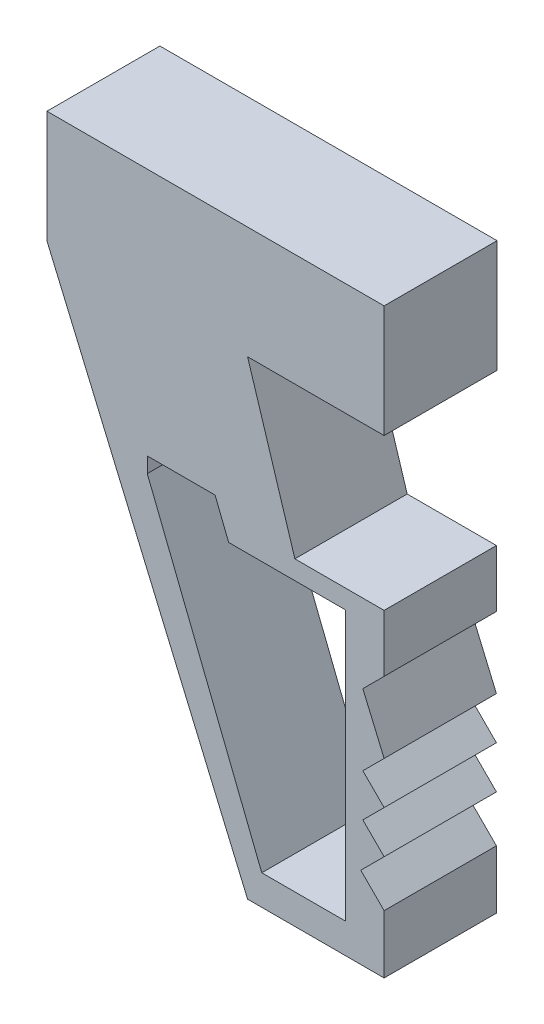
ISO-10303-21;
HEADER;
FILE_DESCRIPTION(('STEP AP214'),'2;1');
FILE_NAME('part.step','',(''),(''),'','','');
FILE_SCHEMA(('AUTOMOTIVE_DESIGN { 1 0 10303 214 1 1 1 1 }'));
ENDSEC;
DATA;
#1=APPLICATION_CONTEXT('core data for automotive mechanical design processes');
#2=APPLICATION_PROTOCOL_DEFINITION('international standard','automotive_design',2000,#1);
#3=PRODUCT_CONTEXT('',#1,'mechanical');
#4=PRODUCT('Part','Part','',(#3));
#5=PRODUCT_RELATED_PRODUCT_CATEGORY('part','',(#4));
#6=PRODUCT_DEFINITION_FORMATION('','',#4);
#7=PRODUCT_DEFINITION_CONTEXT('part definition',#1,'design');
#8=PRODUCT_DEFINITION('design','',#6,#7);
#9=PRODUCT_DEFINITION_SHAPE('','',#8);
#10=(LENGTH_UNIT() NAMED_UNIT(*) SI_UNIT(.MILLI.,.METRE.));
#11=(NAMED_UNIT(*) PLANE_ANGLE_UNIT() SI_UNIT($,.RADIAN.));
#12=(NAMED_UNIT(*) SI_UNIT($,.STERADIAN.) SOLID_ANGLE_UNIT());
#13=UNCERTAINTY_MEASURE_WITH_UNIT(LENGTH_MEASURE(1.E-05),#10,'distance_accuracy_value','');
#14=(GEOMETRIC_REPRESENTATION_CONTEXT(3) GLOBAL_UNCERTAINTY_ASSIGNED_CONTEXT((#13)) GLOBAL_UNIT_ASSIGNED_CONTEXT((#10,
#11,#12)) REPRESENTATION_CONTEXT('',''));
#15=CARTESIAN_POINT('',(0.,0.,0.));
#16=DIRECTION('',(0.,0.,1.));
#17=DIRECTION('',(1.,0.,0.));
#18=AXIS2_PLACEMENT_3D('',#15,#16,#17);
#19=CARTESIAN_POINT('',(-1501.05561728595,-500.,-251.390382506628));
#20=DIRECTION('',(-1.,0.,0.));
#21=DIRECTION('',(0.,0.,1.));
#22=AXIS2_PLACEMENT_3D('',#19,#20,#21);
#23=PLANE('',#22);
#24=DIRECTION('',(0.,0.,1.));
#25=VECTOR('',#24,1.);
#26=CARTESIAN_POINT('',(-1501.05561728595,0.,-251.390382506628));
#27=LINE('',#26,#25);
#28=CARTESIAN_POINT('',(-1501.05561728595,0.,-251.390382506628));
#29=VERTEX_POINT('',#28);
#30=CARTESIAN_POINT('',(-1501.05561728595,0.,251.390382506628));
#31=VERTEX_POINT('',#30);
#32=EDGE_CURVE('E237',#29,#31,#27,.T.);
#33=ORIENTED_EDGE('',*,*,#32,.F.);
#34=DIRECTION('',(0.,1.,0.));
#35=VECTOR('',#34,1.);
#36=CARTESIAN_POINT('',(-1501.05561728595,-500.,-251.390382506628));
#37=LINE('',#36,#35);
#38=CARTESIAN_POINT('',(-1501.05561728595,-500.,-251.390382506628));
#39=VERTEX_POINT('',#38);
#40=EDGE_CURVE('E11',#39,#29,#37,.T.);
#41=ORIENTED_EDGE('',*,*,#40,.F.);
#42=DIRECTION('',(0.,0.,1.));
#43=VECTOR('',#42,1.);
#44=CARTESIAN_POINT('',(-1501.05561728595,-500.,-251.390382506628));
#45=LINE('',#44,#43);
#46=CARTESIAN_POINT('',(-1501.05561728595,-500.,-248.609617493372));
#47=VERTEX_POINT('',#46);
#48=EDGE_CURVE('E243',#39,#47,#45,.T.);
#49=ORIENTED_EDGE('',*,*,#48,.T.);
#50=DIRECTION('',(0.,0.,1.));
#51=VECTOR('',#50,1.);
#52=CARTESIAN_POINT('',(-1501.05561728595,-500.,-248.609617493372));
#53=LINE('',#52,#51);
#54=CARTESIAN_POINT('',(-1501.05561728595,-500.,251.390382506628));
#55=VERTEX_POINT('',#54);
#56=EDGE_CURVE('E256',#47,#55,#53,.T.);
#57=ORIENTED_EDGE('',*,*,#56,.T.);
#58=DIRECTION('',(0.,1.,0.));
#59=VECTOR('',#58,1.);
#60=CARTESIAN_POINT('',(-1501.05561728595,-500.,251.390382506628));
#61=LINE('',#60,#59);
#62=EDGE_CURVE('E46',#55,#31,#61,.T.);
#63=ORIENTED_EDGE('',*,*,#62,.T.);
#64=EDGE_LOOP('',(#33,#41,#49,#57,#63));
#65=FACE_BOUND('',#64,.T.);
#66=ADVANCED_FACE('F43',(#65),#23,.T.);
#67=CARTESIAN_POINT('',(1501.05561728595,-500.,-251.390382506628));
#68=DIRECTION('',(0.,0.,-1.));
#69=DIRECTION('',(-1.,0.,0.));
#70=AXIS2_PLACEMENT_3D('',#67,#68,#69);
#71=PLANE('',#70);
#72=DIRECTION('',(0.,1.,0.));
#73=VECTOR('',#72,1.);
#74=CARTESIAN_POINT('',(0.,-500.,-251.390382506628));
#75=LINE('',#74,#73);
#76=CARTESIAN_POINT('',(0.,-500.,-251.390382506628));
#77=VERTEX_POINT('',#76);
#78=CARTESIAN_POINT('',(0.,0.,-251.390382506628));
#79=VERTEX_POINT('',#78);
#80=EDGE_CURVE('E58',#77,#79,#75,.T.);
#81=ORIENTED_EDGE('',*,*,#80,.F.);
#82=DIRECTION('',(-1.,0.,0.));
#83=VECTOR('',#82,1.);
#84=CARTESIAN_POINT('',(1501.05561728595,-500.,-251.390382506628));
#85=LINE('',#84,#83);
#86=EDGE_CURVE('E248',#77,#39,#85,.T.);
#87=ORIENTED_EDGE('',*,*,#86,.T.);
#88=ORIENTED_EDGE('',*,*,#40,.T.);
#89=DIRECTION('',(-1.,0.,0.));
#90=VECTOR('',#89,1.);
#91=CARTESIAN_POINT('',(1501.05561728595,0.,-251.390382506628));
#92=LINE('',#91,#90);
#93=EDGE_CURVE('E239',#79,#29,#92,.T.);
#94=ORIENTED_EDGE('',*,*,#93,.F.);
#95=EDGE_LOOP('',(#81,#87,#88,#94));
#96=FACE_BOUND('',#95,.T.);
#97=ADVANCED_FACE('F497',(#96),#71,.T.);
#98=CARTESIAN_POINT('',(1501.05561728595,-500.,251.390382506628));
#99=DIRECTION('',(0.,0.,1.));
#100=DIRECTION('',(1.,0.,0.));
#101=AXIS2_PLACEMENT_3D('',#98,#99,#100);
#102=PLANE('',#101);
#103=DIRECTION('',(0.,-1.,0.));
#104=VECTOR('',#103,1.);
#105=CARTESIAN_POINT('',(0.,0.,251.390382506628));
#106=LINE('',#105,#104);
#107=CARTESIAN_POINT('',(0.,0.,251.390382506628));
#108=VERTEX_POINT('',#107);
#109=CARTESIAN_POINT('',(0.,-500.,251.390382506628));
#110=VERTEX_POINT('',#109);
#111=EDGE_CURVE('E214',#108,#110,#106,.T.);
#112=ORIENTED_EDGE('',*,*,#111,.F.);
#113=DIRECTION('',(1.,0.,0.));
#114=VECTOR('',#113,1.);
#115=CARTESIAN_POINT('',(1501.05561728595,0.,251.390382506628));
#116=LINE('',#115,#114);
#117=EDGE_CURVE('E228',#31,#108,#116,.T.);
#118=ORIENTED_EDGE('',*,*,#117,.F.);
#119=ORIENTED_EDGE('',*,*,#62,.F.);
#120=DIRECTION('',(0.392765324150413,-0.919638733495399,0.));
#121=VECTOR('',#120,1.);
#122=CARTESIAN_POINT('',(-1501.05561728595,-500.,251.390382506628));
#123=LINE('',#122,#121);
#124=CARTESIAN_POINT('',(-607.842059567706,-2591.41116705698,251.390382506628));
#125=VERTEX_POINT('',#124);
#126=EDGE_CURVE('E354',#55,#125,#123,.T.);
#127=ORIENTED_EDGE('',*,*,#126,.T.);
#128=DIRECTION('',(1.,0.,0.));
#129=VECTOR('',#128,1.);
#130=CARTESIAN_POINT('',(-607.842059567706,-2591.41116705698,251.390382506628));
#131=LINE('',#130,#129);
#132=CARTESIAN_POINT('',(0.,-2591.41116705698,251.390382506628));
#133=VERTEX_POINT('',#132);
#134=EDGE_CURVE('E350',#125,#133,#131,.T.);
#135=ORIENTED_EDGE('',*,*,#134,.T.);
#136=DIRECTION('',(0.,1.,0.));
#137=VECTOR('',#136,1.);
#138=CARTESIAN_POINT('',(0.,-2591.41116705698,251.390382506628));
#139=LINE('',#138,#137);
#140=CARTESIAN_POINT('',(0.,-2331.81000535845,251.390382506628));
#141=VERTEX_POINT('',#140);
#142=EDGE_CURVE('E346',#133,#141,#139,.T.);
#143=ORIENTED_EDGE('',*,*,#142,.T.);
#144=DIRECTION('',(-0.707106781186548,0.707106781186547,0.));
#145=VECTOR('',#144,1.);
#146=CARTESIAN_POINT('',(0.,-2331.81000535845,251.390382506628));
#147=LINE('',#146,#145);
#148=CARTESIAN_POINT('',(-103.950328884158,-2227.8596764743,251.390382506628));
#149=VERTEX_POINT('',#148);
#150=EDGE_CURVE('E342',#141,#149,#147,.T.);
#151=ORIENTED_EDGE('',*,*,#150,.T.);
#152=DIRECTION('',(0.707106781186546,0.707106781186549,0.));
#153=VECTOR('',#152,1.);
#154=CARTESIAN_POINT('',(-103.950328884158,-2227.8596764743,251.390382506628));
#155=LINE('',#154,#153);
#156=CARTESIAN_POINT('',(0.,-2123.90934759014,251.390382506628));
#157=VERTEX_POINT('',#156);
#158=EDGE_CURVE('E338',#149,#157,#155,.T.);
#159=ORIENTED_EDGE('',*,*,#158,.T.);
#160=DIRECTION('',(-0.707106781186549,0.707106781186546,0.));
#161=VECTOR('',#160,1.);
#162=CARTESIAN_POINT('',(0.,-2123.90934759014,251.390382506628));
#163=LINE('',#162,#161);
#164=CARTESIAN_POINT('',(-94.7296620680847,-2029.17968552205,251.390382506628));
#165=VERTEX_POINT('',#164);
#166=EDGE_CURVE('E334',#157,#165,#163,.T.);
#167=ORIENTED_EDGE('',*,*,#166,.T.);
#168=DIRECTION('',(0.707106781186546,0.707106781186549,0.));
#169=VECTOR('',#168,1.);
#170=CARTESIAN_POINT('',(-94.7296620680847,-2029.17968552205,251.390382506628));
#171=LINE('',#170,#169);
#172=CARTESIAN_POINT('',(0.,-1934.45002345397,251.390382506628));
#173=VERTEX_POINT('',#172);
#174=EDGE_CURVE('E330',#165,#173,#171,.T.);
#175=ORIENTED_EDGE('',*,*,#174,.T.);
#176=DIRECTION('',(-0.707106781186549,0.707106781186546,0.));
#177=VECTOR('',#176,1.);
#178=CARTESIAN_POINT('',(0.,-1934.45002345397,251.390382506628));
#179=LINE('',#178,#177);
#180=CARTESIAN_POINT('',(-94.7296620680847,-1839.72036138588,251.390382506628));
#181=VERTEX_POINT('',#180);
#182=EDGE_CURVE('E326',#173,#181,#179,.T.);
#183=ORIENTED_EDGE('',*,*,#182,.T.);
#184=DIRECTION('',(0.707106781186546,0.707106781186549,0.));
#185=VECTOR('',#184,1.);
#186=CARTESIAN_POINT('',(-94.7296620680847,-1839.72036138588,251.390382506628));
#187=LINE('',#186,#185);
#188=CARTESIAN_POINT('',(0.,-1744.9906993178,251.390382506628));
#189=VERTEX_POINT('',#188);
#190=EDGE_CURVE('E322',#181,#189,#187,.T.);
#191=ORIENTED_EDGE('',*,*,#190,.T.);
#192=DIRECTION('',(-0.392765324150413,0.919638733495399,0.));
#193=VECTOR('',#192,1.);
#194=CARTESIAN_POINT('',(0.,-1744.9906993178,251.390382506628));
#195=LINE('',#194,#193);
#196=CARTESIAN_POINT('',(-94.7296620680847,-1523.18632634474,251.390382506628));
#197=VERTEX_POINT('',#196);
#198=EDGE_CURVE('E318',#189,#197,#195,.T.);
#199=ORIENTED_EDGE('',*,*,#198,.T.);
#200=DIRECTION('',(0.707106781186546,0.707106781186549,0.));
#201=VECTOR('',#200,1.);
#202=CARTESIAN_POINT('',(-94.7296620680847,-1523.18632634474,251.390382506628));
#203=LINE('',#202,#201);
#204=CARTESIAN_POINT('',(0.,-1428.45666427666,251.390382506628));
#205=VERTEX_POINT('',#204);
#206=EDGE_CURVE('E314',#197,#205,#203,.T.);
#207=ORIENTED_EDGE('',*,*,#206,.T.);
#208=DIRECTION('',(0.,1.,0.));
#209=VECTOR('',#208,1.);
#210=CARTESIAN_POINT('',(0.,-1428.45666427666,251.390382506628));
#211=LINE('',#210,#209);
#212=CARTESIAN_POINT('',(0.,-1173.97474203823,251.390382506628));
#213=VERTEX_POINT('',#212);
#214=EDGE_CURVE('E310',#205,#213,#211,.T.);
#215=ORIENTED_EDGE('',*,*,#214,.T.);
#216=DIRECTION('',(-1.,0.,0.));
#217=VECTOR('',#216,1.);
#218=CARTESIAN_POINT('',(0.,-1173.97474203823,251.390382506628));
#219=LINE('',#218,#217);
#220=CARTESIAN_POINT('',(-397.331699416407,-1173.97474203823,251.390382506628));
#221=VERTEX_POINT('',#220);
#222=EDGE_CURVE('E306',#213,#221,#219,.T.);
#223=ORIENTED_EDGE('',*,*,#222,.T.);
#224=DIRECTION('',(-0.298137259243626,0.95452300896872,0.));
#225=VECTOR('',#224,1.);
#226=CARTESIAN_POINT('',(-397.331699416407,-1173.97474203823,251.390382506628));
#227=LINE('',#226,#225);
#228=CARTESIAN_POINT('',(-607.842059567706,-500.,251.390382506628));
#229=VERTEX_POINT('',#228);
#230=EDGE_CURVE('E302',#221,#229,#227,.T.);
#231=ORIENTED_EDGE('',*,*,#230,.T.);
#232=DIRECTION('',(1.,0.,0.));
#233=VECTOR('',#232,1.);
#234=CARTESIAN_POINT('',(1501.05561728595,-500.,251.390382506628));
#235=LINE('',#234,#233);
#236=EDGE_CURVE('E232',#229,#110,#235,.T.);
#237=ORIENTED_EDGE('',*,*,#236,.T.);
#238=EDGE_LOOP('',(#112,#118,#119,#127,#135,#143,#151,#159,#167,#175,#183,#191,#199,#207,#215,
#223,#231,#237));
#239=FACE_BOUND('',#238,.T.);
#240=DIRECTION('',(0.368965054182411,-0.929443268194552,0.));
#241=VECTOR('',#240,1.);
#242=CARTESIAN_POINT('',(-1054.44883842683,-1173.97474203823,251.390382506628));
#243=LINE('',#242,#241);
#244=CARTESIAN_POINT('',(-1054.44883842683,-1173.97474203823,251.390382506628));
#245=VERTEX_POINT('',#244);
#246=CARTESIAN_POINT('',(-544.688951522317,-2458.08793896115,251.390382506628));
#247=VERTEX_POINT('',#246);
#248=EDGE_CURVE('E458',#245,#247,#243,.T.);
#249=ORIENTED_EDGE('',*,*,#248,.F.);
#250=DIRECTION('',(0.,-1.,0.));
#251=VECTOR('',#250,1.);
#252=CARTESIAN_POINT('',(-1054.44883842683,-1105.66123290551,251.390382506628));
#253=LINE('',#252,#251);
#254=CARTESIAN_POINT('',(-1054.44883842683,-1105.66123290551,251.390382506628));
#255=VERTEX_POINT('',#254);
#256=EDGE_CURVE('E462',#255,#245,#253,.T.);
#257=ORIENTED_EDGE('',*,*,#256,.F.);
#258=DIRECTION('',(-1.,0.,0.));
#259=VECTOR('',#258,1.);
#260=CARTESIAN_POINT('',(-752.591786236543,-1105.66123290551,251.390382506628));
#261=LINE('',#260,#259);
#262=CARTESIAN_POINT('',(-752.591786236543,-1105.66123290551,251.390382506628));
#263=VERTEX_POINT('',#262);
#264=EDGE_CURVE('E437',#263,#255,#261,.T.);
#265=ORIENTED_EDGE('',*,*,#264,.F.);
#266=DIRECTION('',(-0.368965054182411,0.929443268194552,0.));
#267=VECTOR('',#266,1.);
#268=CARTESIAN_POINT('',(-692.046203628226,-1258.17888609875,251.390382506628));
#269=LINE('',#268,#267);
#270=CARTESIAN_POINT('',(-692.046203628226,-1258.17888609875,251.390382506628));
#271=VERTEX_POINT('',#270);
#272=EDGE_CURVE('E442',#271,#263,#269,.T.);
#273=ORIENTED_EDGE('',*,*,#272,.F.);
#274=DIRECTION('',(-1.,0.,0.));
#275=VECTOR('',#274,1.);
#276=CARTESIAN_POINT('',(-172.787315255021,-1258.17888609875,251.390382506628));
#277=LINE('',#276,#275);
#278=CARTESIAN_POINT('',(-172.787315255021,-1258.17888609875,251.390382506628));
#279=VERTEX_POINT('',#278);
#280=EDGE_CURVE('E446',#279,#271,#277,.T.);
#281=ORIENTED_EDGE('',*,*,#280,.F.);
#282=DIRECTION('',(0.,1.,0.));
#283=VECTOR('',#282,1.);
#284=CARTESIAN_POINT('',(-172.787315255021,-2458.08793896115,251.390382506628));
#285=LINE('',#284,#283);
#286=CARTESIAN_POINT('',(-172.787315255021,-2458.08793896115,251.390382506628));
#287=VERTEX_POINT('',#286);
#288=EDGE_CURVE('E450',#287,#279,#285,.T.);
#289=ORIENTED_EDGE('',*,*,#288,.F.);
#290=DIRECTION('',(1.,0.,0.));
#291=VECTOR('',#290,1.);
#292=CARTESIAN_POINT('',(-172.787315255021,-2458.08793896115,251.390382506628));
#293=LINE('',#292,#291);
#294=EDGE_CURVE('E454',#247,#287,#293,.T.);
#295=ORIENTED_EDGE('',*,*,#294,.F.);
#296=EDGE_LOOP('',(#249,#257,#265,#273,#281,#289,#295));
#297=FACE_BOUND('',#296,.T.);
#298=ADVANCED_FACE('F225',(#239,#297),#102,.T.);
#299=CARTESIAN_POINT('',(0.,-500.,0.));
#300=DIRECTION('',(0.,-1.,0.));
#301=DIRECTION('',(0.,0.,-1.));
#302=AXIS2_PLACEMENT_3D('',#299,#300,#301);
#303=PLANE('',#302);
#304=DIRECTION('',(0.,0.,-1.));
#305=VECTOR('',#304,1.);
#306=CARTESIAN_POINT('',(0.,-500.,0.));
#307=LINE('',#306,#305);
#308=EDGE_CURVE('E220',#110,#77,#307,.T.);
#309=ORIENTED_EDGE('',*,*,#308,.F.);
#310=ORIENTED_EDGE('',*,*,#236,.F.);
#311=DIRECTION('',(0.,0.,1.));
#312=VECTOR('',#311,1.);
#313=CARTESIAN_POINT('',(-607.842059567706,-500.,-248.609617493372));
#314=LINE('',#313,#312);
#315=CARTESIAN_POINT('',(-607.842059567706,-500.,-248.609617493372));
#316=VERTEX_POINT('',#315);
#317=EDGE_CURVE('E245',#316,#229,#314,.T.);
#318=ORIENTED_EDGE('',*,*,#317,.F.);
#319=DIRECTION('',(-1.,0.,0.));
#320=VECTOR('',#319,1.);
#321=CARTESIAN_POINT('',(-607.842059567706,-500.,-248.609617493372));
#322=LINE('',#321,#320);
#323=EDGE_CURVE('E305',#316,#47,#322,.T.);
#324=ORIENTED_EDGE('',*,*,#323,.T.);
#325=ORIENTED_EDGE('',*,*,#48,.F.);
#326=ORIENTED_EDGE('',*,*,#86,.F.);
#327=EDGE_LOOP('',(#309,#310,#318,#324,#325,#326));
#328=FACE_BOUND('',#327,.T.);
#329=ADVANCED_FACE('F500',(#328),#303,.T.);
#330=CARTESIAN_POINT('',(0.,0.,0.));
#331=DIRECTION('',(0.,-1.,0.));
#332=DIRECTION('',(0.,0.,-1.));
#333=AXIS2_PLACEMENT_3D('',#330,#331,#332);
#334=PLANE('',#333);
#335=ORIENTED_EDGE('',*,*,#117,.T.);
#336=DIRECTION('',(0.,0.,1.));
#337=VECTOR('',#336,1.);
#338=CARTESIAN_POINT('',(0.,0.,-1211.60961749337));
#339=LINE('',#338,#337);
#340=EDGE_CURVE('E211',#79,#108,#339,.T.);
#341=ORIENTED_EDGE('',*,*,#340,.F.);
#342=ORIENTED_EDGE('',*,*,#93,.T.);
#343=ORIENTED_EDGE('',*,*,#32,.T.);
#344=EDGE_LOOP('',(#335,#341,#342,#343));
#345=FACE_BOUND('',#344,.T.);
#346=ADVANCED_FACE('F235',(#345),#334,.F.);
#347=CARTESIAN_POINT('',(-397.331699416407,-1173.97474203823,-248.609617493372));
#348=DIRECTION('',(0.95452300896872,0.298137259243626,0.));
#349=DIRECTION('',(-0.298137259243626,0.95452300896872,0.));
#350=AXIS2_PLACEMENT_3D('',#347,#348,#349);
#351=PLANE('',#350);
#352=ORIENTED_EDGE('',*,*,#230,.F.);
#353=DIRECTION('',(0.,0.,1.));
#354=VECTOR('',#353,1.);
#355=CARTESIAN_POINT('',(-397.331699416407,-1173.97474203823,-248.609617493372));
#356=LINE('',#355,#354);
#357=CARTESIAN_POINT('',(-397.331699416407,-1173.97474203823,-248.609617493372));
#358=VERTEX_POINT('',#357);
#359=EDGE_CURVE('E297',#358,#221,#356,.T.);
#360=ORIENTED_EDGE('',*,*,#359,.F.);
#361=DIRECTION('',(-0.298137259243626,0.95452300896872,0.));
#362=VECTOR('',#361,1.);
#363=CARTESIAN_POINT('',(-397.331699416407,-1173.97474203823,-248.609617493372));
#364=LINE('',#363,#362);
#365=EDGE_CURVE('E261',#358,#316,#364,.T.);
#366=ORIENTED_EDGE('',*,*,#365,.T.);
#367=ORIENTED_EDGE('',*,*,#317,.T.);
#368=EDGE_LOOP('',(#352,#360,#366,#367));
#369=FACE_BOUND('',#368,.T.);
#370=ADVANCED_FACE('F553',(#369),#351,.T.);
#371=CARTESIAN_POINT('',(0.,-1173.97474203823,-248.609617493372));
#372=DIRECTION('',(0.,1.,0.));
#373=DIRECTION('',(0.,0.,1.));
#374=AXIS2_PLACEMENT_3D('',#371,#372,#373);
#375=PLANE('',#374);
#376=ORIENTED_EDGE('',*,*,#222,.F.);
#377=DIRECTION('',(0.,0.,1.));
#378=VECTOR('',#377,1.);
#379=CARTESIAN_POINT('',(0.,-1173.97474203823,-248.609617493372));
#380=LINE('',#379,#378);
#381=CARTESIAN_POINT('',(0.,-1173.97474203823,-248.609617493372));
#382=VERTEX_POINT('',#381);
#383=EDGE_CURVE('E294',#382,#213,#380,.T.);
#384=ORIENTED_EDGE('',*,*,#383,.F.);
#385=DIRECTION('',(-1.,0.,0.));
#386=VECTOR('',#385,1.);
#387=CARTESIAN_POINT('',(0.,-1173.97474203823,-248.609617493372));
#388=LINE('',#387,#386);
#389=EDGE_CURVE('E362',#382,#358,#388,.T.);
#390=ORIENTED_EDGE('',*,*,#389,.T.);
#391=ORIENTED_EDGE('',*,*,#359,.T.);
#392=EDGE_LOOP('',(#376,#384,#390,#391));
#393=FACE_BOUND('',#392,.T.);
#394=ADVANCED_FACE('F557',(#393),#375,.T.);
#395=CARTESIAN_POINT('',(0.,-1428.45666427666,-248.609617493372));
#396=DIRECTION('',(1.,0.,0.));
#397=DIRECTION('',(0.,1.,0.));
#398=AXIS2_PLACEMENT_3D('',#395,#396,#397);
#399=PLANE('',#398);
#400=ORIENTED_EDGE('',*,*,#214,.F.);
#401=DIRECTION('',(0.,0.,1.));
#402=VECTOR('',#401,1.);
#403=CARTESIAN_POINT('',(0.,-1428.45666427666,-248.609617493372));
#404=LINE('',#403,#402);
#405=CARTESIAN_POINT('',(0.,-1428.45666427666,-248.609617493372));
#406=VERTEX_POINT('',#405);
#407=EDGE_CURVE('E291',#406,#205,#404,.T.);
#408=ORIENTED_EDGE('',*,*,#407,.F.);
#409=DIRECTION('',(0.,1.,0.));
#410=VECTOR('',#409,1.);
#411=CARTESIAN_POINT('',(0.,-1428.45666427666,-248.609617493372));
#412=LINE('',#411,#410);
#413=EDGE_CURVE('E366',#406,#382,#412,.T.);
#414=ORIENTED_EDGE('',*,*,#413,.T.);
#415=ORIENTED_EDGE('',*,*,#383,.T.);
#416=EDGE_LOOP('',(#400,#408,#414,#415));
#417=FACE_BOUND('',#416,.T.);
#418=ADVANCED_FACE('F548',(#417),#399,.T.);
#419=CARTESIAN_POINT('',(-94.7296620680847,-1523.18632634474,-248.609617493372));
#420=DIRECTION('',(0.707106781186549,-0.707106781186546,0.));
#421=DIRECTION('',(0.707106781186546,0.707106781186549,0.));
#422=AXIS2_PLACEMENT_3D('',#419,#420,#421);
#423=PLANE('',#422);
#424=ORIENTED_EDGE('',*,*,#206,.F.);
#425=DIRECTION('',(0.,0.,1.));
#426=VECTOR('',#425,1.);
#427=CARTESIAN_POINT('',(-94.7296620680847,-1523.18632634474,-248.609617493372));
#428=LINE('',#427,#426);
#429=CARTESIAN_POINT('',(-94.7296620680847,-1523.18632634474,-248.609617493372));
#430=VERTEX_POINT('',#429);
#431=EDGE_CURVE('E288',#430,#197,#428,.T.);
#432=ORIENTED_EDGE('',*,*,#431,.F.);
#433=DIRECTION('',(0.707106781186546,0.707106781186549,0.));
#434=VECTOR('',#433,1.);
#435=CARTESIAN_POINT('',(-94.7296620680847,-1523.18632634474,-248.609617493372));
#436=LINE('',#435,#434);
#437=EDGE_CURVE('E370',#430,#406,#436,.T.);
#438=ORIENTED_EDGE('',*,*,#437,.T.);
#439=ORIENTED_EDGE('',*,*,#407,.T.);
#440=EDGE_LOOP('',(#424,#432,#438,#439));
#441=FACE_BOUND('',#440,.T.);
#442=ADVANCED_FACE('F544',(#441),#423,.T.);
#443=CARTESIAN_POINT('',(0.,-1744.9906993178,-248.609617493372));
#444=DIRECTION('',(0.919638733495399,0.392765324150413,0.));
#445=DIRECTION('',(-0.392765324150413,0.919638733495399,0.));
#446=AXIS2_PLACEMENT_3D('',#443,#444,#445);
#447=PLANE('',#446);
#448=ORIENTED_EDGE('',*,*,#198,.F.);
#449=DIRECTION('',(0.,0.,1.));
#450=VECTOR('',#449,1.);
#451=CARTESIAN_POINT('',(0.,-1744.9906993178,-248.609617493372));
#452=LINE('',#451,#450);
#453=CARTESIAN_POINT('',(0.,-1744.9906993178,-248.609617493372));
#454=VERTEX_POINT('',#453);
#455=EDGE_CURVE('E285',#454,#189,#452,.T.);
#456=ORIENTED_EDGE('',*,*,#455,.F.);
#457=DIRECTION('',(-0.392765324150413,0.919638733495399,0.));
#458=VECTOR('',#457,1.);
#459=CARTESIAN_POINT('',(0.,-1744.9906993178,-248.609617493372));
#460=LINE('',#459,#458);
#461=EDGE_CURVE('E374',#454,#430,#460,.T.);
#462=ORIENTED_EDGE('',*,*,#461,.T.);
#463=ORIENTED_EDGE('',*,*,#431,.T.);
#464=EDGE_LOOP('',(#448,#456,#462,#463));
#465=FACE_BOUND('',#464,.T.);
#466=ADVANCED_FACE('F540',(#465),#447,.T.);
#467=CARTESIAN_POINT('',(-94.7296620680847,-1839.72036138588,-248.609617493372));
#468=DIRECTION('',(0.707106781186549,-0.707106781186546,0.));
#469=DIRECTION('',(0.707106781186546,0.707106781186549,0.));
#470=AXIS2_PLACEMENT_3D('',#467,#468,#469);
#471=PLANE('',#470);
#472=ORIENTED_EDGE('',*,*,#190,.F.);
#473=DIRECTION('',(0.,0.,1.));
#474=VECTOR('',#473,1.);
#475=CARTESIAN_POINT('',(-94.7296620680847,-1839.72036138588,-248.609617493372));
#476=LINE('',#475,#474);
#477=CARTESIAN_POINT('',(-94.7296620680847,-1839.72036138588,-248.609617493372));
#478=VERTEX_POINT('',#477);
#479=EDGE_CURVE('E282',#478,#181,#476,.T.);
#480=ORIENTED_EDGE('',*,*,#479,.F.);
#481=DIRECTION('',(0.707106781186546,0.707106781186549,0.));
#482=VECTOR('',#481,1.);
#483=CARTESIAN_POINT('',(-94.7296620680847,-1839.72036138588,-248.609617493372));
#484=LINE('',#483,#482);
#485=EDGE_CURVE('E378',#478,#454,#484,.T.);
#486=ORIENTED_EDGE('',*,*,#485,.T.);
#487=ORIENTED_EDGE('',*,*,#455,.T.);
#488=EDGE_LOOP('',(#472,#480,#486,#487));
#489=FACE_BOUND('',#488,.T.);
#490=ADVANCED_FACE('F536',(#489),#471,.T.);
#491=CARTESIAN_POINT('',(0.,-1934.45002345397,-248.609617493372));
#492=DIRECTION('',(0.707106781186546,0.707106781186549,0.));
#493=DIRECTION('',(-0.707106781186549,0.707106781186546,0.));
#494=AXIS2_PLACEMENT_3D('',#491,#492,#493);
#495=PLANE('',#494);
#496=ORIENTED_EDGE('',*,*,#182,.F.);
#497=DIRECTION('',(0.,0.,1.));
#498=VECTOR('',#497,1.);
#499=CARTESIAN_POINT('',(0.,-1934.45002345397,-248.609617493372));
#500=LINE('',#499,#498);
#501=CARTESIAN_POINT('',(0.,-1934.45002345397,-248.609617493372));
#502=VERTEX_POINT('',#501);
#503=EDGE_CURVE('E279',#502,#173,#500,.T.);
#504=ORIENTED_EDGE('',*,*,#503,.F.);
#505=DIRECTION('',(-0.707106781186549,0.707106781186546,0.));
#506=VECTOR('',#505,1.);
#507=CARTESIAN_POINT('',(0.,-1934.45002345397,-248.609617493372));
#508=LINE('',#507,#506);
#509=EDGE_CURVE('E382',#502,#478,#508,.T.);
#510=ORIENTED_EDGE('',*,*,#509,.T.);
#511=ORIENTED_EDGE('',*,*,#479,.T.);
#512=EDGE_LOOP('',(#496,#504,#510,#511));
#513=FACE_BOUND('',#512,.T.);
#514=ADVANCED_FACE('F532',(#513),#495,.T.);
#515=CARTESIAN_POINT('',(-94.7296620680847,-2029.17968552205,-248.609617493372));
#516=DIRECTION('',(0.707106781186549,-0.707106781186546,0.));
#517=DIRECTION('',(0.707106781186546,0.707106781186549,0.));
#518=AXIS2_PLACEMENT_3D('',#515,#516,#517);
#519=PLANE('',#518);
#520=ORIENTED_EDGE('',*,*,#174,.F.);
#521=DIRECTION('',(0.,0.,1.));
#522=VECTOR('',#521,1.);
#523=CARTESIAN_POINT('',(-94.7296620680847,-2029.17968552205,-248.609617493372));
#524=LINE('',#523,#522);
#525=CARTESIAN_POINT('',(-94.7296620680847,-2029.17968552205,-248.609617493372));
#526=VERTEX_POINT('',#525);
#527=EDGE_CURVE('E276',#526,#165,#524,.T.);
#528=ORIENTED_EDGE('',*,*,#527,.F.);
#529=DIRECTION('',(0.707106781186546,0.707106781186549,0.));
#530=VECTOR('',#529,1.);
#531=CARTESIAN_POINT('',(-94.7296620680847,-2029.17968552205,-248.609617493372));
#532=LINE('',#531,#530);
#533=EDGE_CURVE('E386',#526,#502,#532,.T.);
#534=ORIENTED_EDGE('',*,*,#533,.T.);
#535=ORIENTED_EDGE('',*,*,#503,.T.);
#536=EDGE_LOOP('',(#520,#528,#534,#535));
#537=FACE_BOUND('',#536,.T.);
#538=ADVANCED_FACE('F528',(#537),#519,.T.);
#539=CARTESIAN_POINT('',(0.,-2123.90934759014,-248.609617493372));
#540=DIRECTION('',(0.707106781186546,0.707106781186549,0.));
#541=DIRECTION('',(-0.707106781186549,0.707106781186546,0.));
#542=AXIS2_PLACEMENT_3D('',#539,#540,#541);
#543=PLANE('',#542);
#544=ORIENTED_EDGE('',*,*,#166,.F.);
#545=DIRECTION('',(0.,0.,1.));
#546=VECTOR('',#545,1.);
#547=CARTESIAN_POINT('',(0.,-2123.90934759014,-248.609617493372));
#548=LINE('',#547,#546);
#549=CARTESIAN_POINT('',(0.,-2123.90934759014,-248.609617493372));
#550=VERTEX_POINT('',#549);
#551=EDGE_CURVE('E273',#550,#157,#548,.T.);
#552=ORIENTED_EDGE('',*,*,#551,.F.);
#553=DIRECTION('',(-0.707106781186549,0.707106781186546,0.));
#554=VECTOR('',#553,1.);
#555=CARTESIAN_POINT('',(0.,-2123.90934759014,-248.609617493372));
#556=LINE('',#555,#554);
#557=EDGE_CURVE('E390',#550,#526,#556,.T.);
#558=ORIENTED_EDGE('',*,*,#557,.T.);
#559=ORIENTED_EDGE('',*,*,#527,.T.);
#560=EDGE_LOOP('',(#544,#552,#558,#559));
#561=FACE_BOUND('',#560,.T.);
#562=ADVANCED_FACE('F524',(#561),#543,.T.);
#563=CARTESIAN_POINT('',(-103.950328884158,-2227.8596764743,-248.609617493372));
#564=DIRECTION('',(0.707106781186549,-0.707106781186546,0.));
#565=DIRECTION('',(0.707106781186546,0.707106781186549,0.));
#566=AXIS2_PLACEMENT_3D('',#563,#564,#565);
#567=PLANE('',#566);
#568=ORIENTED_EDGE('',*,*,#158,.F.);
#569=DIRECTION('',(0.,0.,1.));
#570=VECTOR('',#569,1.);
#571=CARTESIAN_POINT('',(-103.950328884158,-2227.8596764743,-248.609617493372));
#572=LINE('',#571,#570);
#573=CARTESIAN_POINT('',(-103.950328884158,-2227.8596764743,-248.609617493372));
#574=VERTEX_POINT('',#573);
#575=EDGE_CURVE('E270',#574,#149,#572,.T.);
#576=ORIENTED_EDGE('',*,*,#575,.F.);
#577=DIRECTION('',(0.707106781186546,0.707106781186549,0.));
#578=VECTOR('',#577,1.);
#579=CARTESIAN_POINT('',(-103.950328884158,-2227.8596764743,-248.609617493372));
#580=LINE('',#579,#578);
#581=EDGE_CURVE('E394',#574,#550,#580,.T.);
#582=ORIENTED_EDGE('',*,*,#581,.T.);
#583=ORIENTED_EDGE('',*,*,#551,.T.);
#584=EDGE_LOOP('',(#568,#576,#582,#583));
#585=FACE_BOUND('',#584,.T.);
#586=ADVANCED_FACE('F520',(#585),#567,.T.);
#587=CARTESIAN_POINT('',(0.,-2331.81000535845,-248.609617493372));
#588=DIRECTION('',(0.707106781186547,0.707106781186548,0.));
#589=DIRECTION('',(-0.707106781186548,0.707106781186547,0.));
#590=AXIS2_PLACEMENT_3D('',#587,#588,#589);
#591=PLANE('',#590);
#592=ORIENTED_EDGE('',*,*,#150,.F.);
#593=DIRECTION('',(0.,0.,1.));
#594=VECTOR('',#593,1.);
#595=CARTESIAN_POINT('',(0.,-2331.81000535845,-248.609617493372));
#596=LINE('',#595,#594);
#597=CARTESIAN_POINT('',(0.,-2331.81000535845,-248.609617493372));
#598=VERTEX_POINT('',#597);
#599=EDGE_CURVE('E267',#598,#141,#596,.T.);
#600=ORIENTED_EDGE('',*,*,#599,.F.);
#601=DIRECTION('',(-0.707106781186548,0.707106781186547,0.));
#602=VECTOR('',#601,1.);
#603=CARTESIAN_POINT('',(0.,-2331.81000535845,-248.609617493372));
#604=LINE('',#603,#602);
#605=EDGE_CURVE('E398',#598,#574,#604,.T.);
#606=ORIENTED_EDGE('',*,*,#605,.T.);
#607=ORIENTED_EDGE('',*,*,#575,.T.);
#608=EDGE_LOOP('',(#592,#600,#606,#607));
#609=FACE_BOUND('',#608,.T.);
#610=ADVANCED_FACE('F516',(#609),#591,.T.);
#611=CARTESIAN_POINT('',(0.,-2591.41116705698,-248.609617493372));
#612=DIRECTION('',(1.,0.,0.));
#613=DIRECTION('',(0.,0.,-1.));
#614=AXIS2_PLACEMENT_3D('',#611,#612,#613);
#615=PLANE('',#614);
#616=ORIENTED_EDGE('',*,*,#142,.F.);
#617=DIRECTION('',(0.,0.,1.));
#618=VECTOR('',#617,1.);
#619=CARTESIAN_POINT('',(0.,-2591.41116705698,-248.609617493372));
#620=LINE('',#619,#618);
#621=CARTESIAN_POINT('',(0.,-2591.41116705698,-248.609617493372));
#622=VERTEX_POINT('',#621);
#623=EDGE_CURVE('E264',#622,#133,#620,.T.);
#624=ORIENTED_EDGE('',*,*,#623,.F.);
#625=DIRECTION('',(0.,1.,0.));
#626=VECTOR('',#625,1.);
#627=CARTESIAN_POINT('',(0.,-2591.41116705698,-248.609617493372));
#628=LINE('',#627,#626);
#629=EDGE_CURVE('E402',#622,#598,#628,.T.);
#630=ORIENTED_EDGE('',*,*,#629,.T.);
#631=ORIENTED_EDGE('',*,*,#599,.T.);
#632=EDGE_LOOP('',(#616,#624,#630,#631));
#633=FACE_BOUND('',#632,.T.);
#634=ADVANCED_FACE('F512',(#633),#615,.T.);
#635=CARTESIAN_POINT('',(-607.842059567706,-2591.41116705698,-248.609617493372));
#636=DIRECTION('',(0.,-1.,0.));
#637=DIRECTION('',(0.,0.,-1.));
#638=AXIS2_PLACEMENT_3D('',#635,#636,#637);
#639=PLANE('',#638);
#640=ORIENTED_EDGE('',*,*,#134,.F.);
#641=DIRECTION('',(0.,0.,1.));
#642=VECTOR('',#641,1.);
#643=CARTESIAN_POINT('',(-607.842059567706,-2591.41116705698,-248.609617493372));
#644=LINE('',#643,#642);
#645=CARTESIAN_POINT('',(-607.842059567706,-2591.41116705698,-248.609617493372));
#646=VERTEX_POINT('',#645);
#647=EDGE_CURVE('E260',#646,#125,#644,.T.);
#648=ORIENTED_EDGE('',*,*,#647,.F.);
#649=DIRECTION('',(1.,0.,0.));
#650=VECTOR('',#649,1.);
#651=CARTESIAN_POINT('',(-607.842059567706,-2591.41116705698,-248.609617493372));
#652=LINE('',#651,#650);
#653=EDGE_CURVE('E406',#646,#622,#652,.T.);
#654=ORIENTED_EDGE('',*,*,#653,.T.);
#655=ORIENTED_EDGE('',*,*,#623,.T.);
#656=EDGE_LOOP('',(#640,#648,#654,#655));
#657=FACE_BOUND('',#656,.T.);
#658=ADVANCED_FACE('F508',(#657),#639,.T.);
#659=CARTESIAN_POINT('',(-1501.05561728595,-500.,-248.609617493372));
#660=DIRECTION('',(-0.919638733495399,-0.392765324150413,0.));
#661=DIRECTION('',(0.392765324150413,-0.919638733495399,0.));
#662=AXIS2_PLACEMENT_3D('',#659,#660,#661);
#663=PLANE('',#662);
#664=ORIENTED_EDGE('',*,*,#126,.F.);
#665=ORIENTED_EDGE('',*,*,#56,.F.);
#666=DIRECTION('',(0.392765324150413,-0.919638733495399,0.));
#667=VECTOR('',#666,1.);
#668=CARTESIAN_POINT('',(-1501.05561728595,-500.,-248.609617493372));
#669=LINE('',#668,#667);
#670=EDGE_CURVE('E66',#47,#646,#669,.T.);
#671=ORIENTED_EDGE('',*,*,#670,.T.);
#672=ORIENTED_EDGE('',*,*,#647,.T.);
#673=EDGE_LOOP('',(#664,#665,#671,#672));
#674=FACE_BOUND('',#673,.T.);
#675=ADVANCED_FACE('F506',(#674),#663,.T.);
#676=CARTESIAN_POINT('',(0.,0.,-248.609617493372));
#677=DIRECTION('',(0.,0.,-1.));
#678=DIRECTION('',(-1.,0.,0.));
#679=AXIS2_PLACEMENT_3D('',#676,#677,#678);
#680=PLANE('',#679);
#681=DIRECTION('',(0.,-1.,0.));
#682=VECTOR('',#681,1.);
#683=CARTESIAN_POINT('',(-1054.44883842683,-1105.66123290551,-248.609617493372));
#684=LINE('',#683,#682);
#685=CARTESIAN_POINT('',(-1054.44883842683,-1105.66123290551,-248.609617493372));
#686=VERTEX_POINT('',#685);
#687=CARTESIAN_POINT('',(-1054.44883842683,-1173.97474203823,-248.609617493372));
#688=VERTEX_POINT('',#687);
#689=EDGE_CURVE('E441',#686,#688,#684,.T.);
#690=ORIENTED_EDGE('',*,*,#689,.T.);
#691=DIRECTION('',(0.368965054182411,-0.929443268194552,0.));
#692=VECTOR('',#691,1.);
#693=CARTESIAN_POINT('',(-1054.44883842683,-1173.97474203823,-248.609617493372));
#694=LINE('',#693,#692);
#695=CARTESIAN_POINT('',(-544.688951522317,-2458.08793896115,-248.609617493372));
#696=VERTEX_POINT('',#695);
#697=EDGE_CURVE('E484',#688,#696,#694,.T.);
#698=ORIENTED_EDGE('',*,*,#697,.T.);
#699=DIRECTION('',(1.,0.,0.));
#700=VECTOR('',#699,1.);
#701=CARTESIAN_POINT('',(-172.787315255021,-2458.08793896115,-248.609617493372));
#702=LINE('',#701,#700);
#703=CARTESIAN_POINT('',(-172.787315255021,-2458.08793896115,-248.609617493372));
#704=VERTEX_POINT('',#703);
#705=EDGE_CURVE('E480',#696,#704,#702,.T.);
#706=ORIENTED_EDGE('',*,*,#705,.T.);
#707=DIRECTION('',(0.,1.,0.));
#708=VECTOR('',#707,1.);
#709=CARTESIAN_POINT('',(-172.787315255021,-2458.08793896115,-248.609617493372));
#710=LINE('',#709,#708);
#711=CARTESIAN_POINT('',(-172.787315255021,-1258.17888609875,-248.609617493372));
#712=VERTEX_POINT('',#711);
#713=EDGE_CURVE('E476',#704,#712,#710,.T.);
#714=ORIENTED_EDGE('',*,*,#713,.T.);
#715=DIRECTION('',(-1.,0.,0.));
#716=VECTOR('',#715,1.);
#717=CARTESIAN_POINT('',(-172.787315255021,-1258.17888609875,-248.609617493372));
#718=LINE('',#717,#716);
#719=CARTESIAN_POINT('',(-692.046203628226,-1258.17888609875,-248.609617493372));
#720=VERTEX_POINT('',#719);
#721=EDGE_CURVE('E472',#712,#720,#718,.T.);
#722=ORIENTED_EDGE('',*,*,#721,.T.);
#723=DIRECTION('',(-0.368965054182411,0.929443268194552,0.));
#724=VECTOR('',#723,1.);
#725=CARTESIAN_POINT('',(-692.046203628226,-1258.17888609875,-248.609617493372));
#726=LINE('',#725,#724);
#727=CARTESIAN_POINT('',(-752.591786236543,-1105.66123290551,-248.609617493372));
#728=VERTEX_POINT('',#727);
#729=EDGE_CURVE('E468',#720,#728,#726,.T.);
#730=ORIENTED_EDGE('',*,*,#729,.T.);
#731=DIRECTION('',(-1.,0.,0.));
#732=VECTOR('',#731,1.);
#733=CARTESIAN_POINT('',(-752.591786236543,-1105.66123290551,-248.609617493372));
#734=LINE('',#733,#732);
#735=EDGE_CURVE('E420',#728,#686,#734,.T.);
#736=ORIENTED_EDGE('',*,*,#735,.T.);
#737=EDGE_LOOP('',(#690,#698,#706,#714,#722,#730,#736));
#738=FACE_BOUND('',#737,.T.);
#739=ORIENTED_EDGE('',*,*,#323,.F.);
#740=ORIENTED_EDGE('',*,*,#365,.F.);
#741=ORIENTED_EDGE('',*,*,#389,.F.);
#742=ORIENTED_EDGE('',*,*,#413,.F.);
#743=ORIENTED_EDGE('',*,*,#437,.F.);
#744=ORIENTED_EDGE('',*,*,#461,.F.);
#745=ORIENTED_EDGE('',*,*,#485,.F.);
#746=ORIENTED_EDGE('',*,*,#509,.F.);
#747=ORIENTED_EDGE('',*,*,#533,.F.);
#748=ORIENTED_EDGE('',*,*,#557,.F.);
#749=ORIENTED_EDGE('',*,*,#581,.F.);
#750=ORIENTED_EDGE('',*,*,#605,.F.);
#751=ORIENTED_EDGE('',*,*,#629,.F.);
#752=ORIENTED_EDGE('',*,*,#653,.F.);
#753=ORIENTED_EDGE('',*,*,#670,.F.);
#754=EDGE_LOOP('',(#739,#740,#741,#742,#743,#744,#745,#746,#747,#748,#749,#750,#751,#752,#753));
#755=FACE_BOUND('',#754,.T.);
#756=ADVANCED_FACE('F556',(#738,#755),#680,.T.);
#757=CARTESIAN_POINT('',(-1054.44883842683,-1105.66123290551,-248.609617493372));
#758=DIRECTION('',(-1.,0.,0.));
#759=DIRECTION('',(0.,0.,1.));
#760=AXIS2_PLACEMENT_3D('',#757,#758,#759);
#761=PLANE('',#760);
#762=ORIENTED_EDGE('',*,*,#256,.T.);
#763=DIRECTION('',(0.,0.,1.));
#764=VECTOR('',#763,1.);
#765=CARTESIAN_POINT('',(-1054.44883842683,-1173.97474203823,-248.609617493372));
#766=LINE('',#765,#764);
#767=EDGE_CURVE('E415',#688,#245,#766,.T.);
#768=ORIENTED_EDGE('',*,*,#767,.F.);
#769=ORIENTED_EDGE('',*,*,#689,.F.);
#770=DIRECTION('',(0.,0.,1.));
#771=VECTOR('',#770,1.);
#772=CARTESIAN_POINT('',(-1054.44883842683,-1105.66123290551,-248.609617493372));
#773=LINE('',#772,#771);
#774=EDGE_CURVE('E358',#686,#255,#773,.T.);
#775=ORIENTED_EDGE('',*,*,#774,.T.);
#776=EDGE_LOOP('',(#762,#768,#769,#775));
#777=FACE_BOUND('',#776,.T.);
#778=ADVANCED_FACE('F650',(#777),#761,.F.);
#779=CARTESIAN_POINT('',(-752.591786236543,-1105.66123290551,-248.609617493372));
#780=DIRECTION('',(0.,1.,0.));
#781=DIRECTION('',(0.,0.,1.));
#782=AXIS2_PLACEMENT_3D('',#779,#780,#781);
#783=PLANE('',#782);
#784=ORIENTED_EDGE('',*,*,#264,.T.);
#785=ORIENTED_EDGE('',*,*,#774,.F.);
#786=ORIENTED_EDGE('',*,*,#735,.F.);
#787=DIRECTION('',(0.,0.,1.));
#788=VECTOR('',#787,1.);
#789=CARTESIAN_POINT('',(-752.591786236543,-1105.66123290551,-248.609617493372));
#790=LINE('',#789,#788);
#791=EDGE_CURVE('E432',#728,#263,#790,.T.);
#792=ORIENTED_EDGE('',*,*,#791,.T.);
#793=EDGE_LOOP('',(#784,#785,#786,#792));
#794=FACE_BOUND('',#793,.T.);
#795=ADVANCED_FACE('F658',(#794),#783,.F.);
#796=CARTESIAN_POINT('',(-692.046203628226,-1258.17888609875,-248.609617493372));
#797=DIRECTION('',(0.929443268194553,0.368965054182411,0.));
#798=DIRECTION('',(-0.368965054182411,0.929443268194552,0.));
#799=AXIS2_PLACEMENT_3D('',#796,#797,#798);
#800=PLANE('',#799);
#801=ORIENTED_EDGE('',*,*,#272,.T.);
#802=ORIENTED_EDGE('',*,*,#791,.F.);
#803=ORIENTED_EDGE('',*,*,#729,.F.);
#804=DIRECTION('',(0.,0.,1.));
#805=VECTOR('',#804,1.);
#806=CARTESIAN_POINT('',(-692.046203628226,-1258.17888609875,-248.609617493372));
#807=LINE('',#806,#805);
#808=EDGE_CURVE('E429',#720,#271,#807,.T.);
#809=ORIENTED_EDGE('',*,*,#808,.T.);
#810=EDGE_LOOP('',(#801,#802,#803,#809));
#811=FACE_BOUND('',#810,.T.);
#812=ADVANCED_FACE('F666',(#811),#800,.F.);
#813=CARTESIAN_POINT('',(-172.787315255021,-1258.17888609875,-248.609617493372));
#814=DIRECTION('',(0.,1.,0.));
#815=DIRECTION('',(0.,0.,1.));
#816=AXIS2_PLACEMENT_3D('',#813,#814,#815);
#817=PLANE('',#816);
#818=ORIENTED_EDGE('',*,*,#280,.T.);
#819=ORIENTED_EDGE('',*,*,#808,.F.);
#820=ORIENTED_EDGE('',*,*,#721,.F.);
#821=DIRECTION('',(0.,0.,1.));
#822=VECTOR('',#821,1.);
#823=CARTESIAN_POINT('',(-172.787315255021,-1258.17888609875,-248.609617493372));
#824=LINE('',#823,#822);
#825=EDGE_CURVE('E426',#712,#279,#824,.T.);
#826=ORIENTED_EDGE('',*,*,#825,.T.);
#827=EDGE_LOOP('',(#818,#819,#820,#826));
#828=FACE_BOUND('',#827,.T.);
#829=ADVANCED_FACE('F674',(#828),#817,.F.);
#830=CARTESIAN_POINT('',(-172.787315255021,-2458.08793896115,-248.609617493372));
#831=DIRECTION('',(1.,0.,0.));
#832=DIRECTION('',(0.,0.,-1.));
#833=AXIS2_PLACEMENT_3D('',#830,#831,#832);
#834=PLANE('',#833);
#835=ORIENTED_EDGE('',*,*,#288,.T.);
#836=ORIENTED_EDGE('',*,*,#825,.F.);
#837=ORIENTED_EDGE('',*,*,#713,.F.);
#838=DIRECTION('',(0.,0.,1.));
#839=VECTOR('',#838,1.);
#840=CARTESIAN_POINT('',(-172.787315255021,-2458.08793896115,-248.609617493372));
#841=LINE('',#840,#839);
#842=EDGE_CURVE('E423',#704,#287,#841,.T.);
#843=ORIENTED_EDGE('',*,*,#842,.T.);
#844=EDGE_LOOP('',(#835,#836,#837,#843));
#845=FACE_BOUND('',#844,.T.);
#846=ADVANCED_FACE('F682',(#845),#834,.F.);
#847=CARTESIAN_POINT('',(-172.787315255021,-2458.08793896115,-248.609617493372));
#848=DIRECTION('',(0.,-1.,0.));
#849=DIRECTION('',(0.,0.,-1.));
#850=AXIS2_PLACEMENT_3D('',#847,#848,#849);
#851=PLANE('',#850);
#852=ORIENTED_EDGE('',*,*,#294,.T.);
#853=ORIENTED_EDGE('',*,*,#842,.F.);
#854=ORIENTED_EDGE('',*,*,#705,.F.);
#855=DIRECTION('',(0.,0.,1.));
#856=VECTOR('',#855,1.);
#857=CARTESIAN_POINT('',(-544.688951522317,-2458.08793896115,-248.609617493372));
#858=LINE('',#857,#856);
#859=EDGE_CURVE('E419',#696,#247,#858,.T.);
#860=ORIENTED_EDGE('',*,*,#859,.T.);
#861=EDGE_LOOP('',(#852,#853,#854,#860));
#862=FACE_BOUND('',#861,.T.);
#863=ADVANCED_FACE('F690',(#862),#851,.F.);
#864=CARTESIAN_POINT('',(-1054.44883842683,-1173.97474203823,-248.609617493372));
#865=DIRECTION('',(-0.929443268194553,-0.368965054182411,0.));
#866=DIRECTION('',(0.368965054182411,-0.929443268194552,0.));
#867=AXIS2_PLACEMENT_3D('',#864,#865,#866);
#868=PLANE('',#867);
#869=ORIENTED_EDGE('',*,*,#248,.T.);
#870=ORIENTED_EDGE('',*,*,#859,.F.);
#871=ORIENTED_EDGE('',*,*,#697,.F.);
#872=ORIENTED_EDGE('',*,*,#767,.T.);
#873=EDGE_LOOP('',(#869,#870,#871,#872));
#874=FACE_BOUND('',#873,.T.);
#875=ADVANCED_FACE('F698',(#874),#868,.F.);
#876=CARTESIAN_POINT('',(0.,0.,-1211.60961749337));
#877=DIRECTION('',(-1.,0.,0.));
#878=DIRECTION('',(0.,0.,1.));
#879=AXIS2_PLACEMENT_3D('',#876,#877,#878);
#880=PLANE('',#879);
#881=ORIENTED_EDGE('',*,*,#80,.T.);
#882=ORIENTED_EDGE('',*,*,#340,.T.);
#883=ORIENTED_EDGE('',*,*,#111,.T.);
#884=ORIENTED_EDGE('',*,*,#308,.T.);
#885=EDGE_LOOP('',(#881,#882,#883,#884));
#886=FACE_BOUND('',#885,.T.);
#887=ADVANCED_FACE('F213',(#886),#880,.F.);
#888=CLOSED_SHELL('',(#66,#97,#298,#329,#346,#370,#394,#418,#442,#466,#490,#514,#538,#562,#586,
#610,#634,#658,#675,#756,#778,#795,#812,#829,#846,#863,#875,#887));
#889=MANIFOLD_SOLID_BREP('B2',#888);
#890=ADVANCED_BREP_SHAPE_REPRESENTATION('',(#18,#889),#14);
#891=SHAPE_DEFINITION_REPRESENTATION(#9,#890);
ENDSEC;
END-ISO-10303-21;
